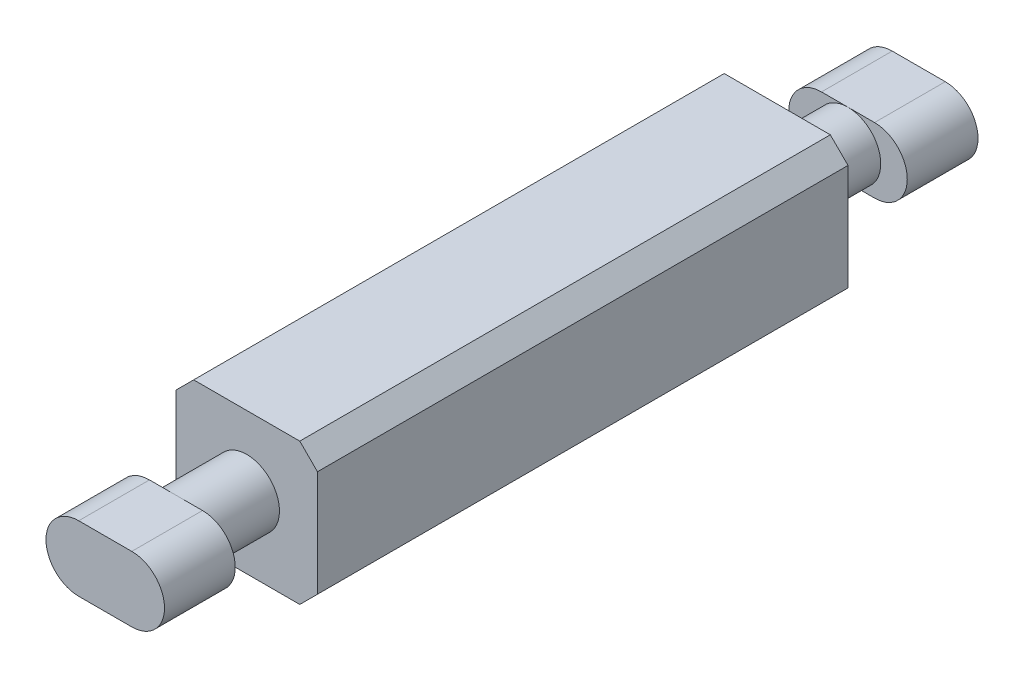
ISO-10303-21;
HEADER;
FILE_DESCRIPTION(('STEP AP214'),'2;1');
FILE_NAME('part.step','',(''),(''),'','','');
FILE_SCHEMA(('AUTOMOTIVE_DESIGN { 1 0 10303 214 1 1 1 1 }'));
ENDSEC;
DATA;
#1=APPLICATION_CONTEXT('core data for automotive mechanical design processes');
#2=APPLICATION_PROTOCOL_DEFINITION('international standard','automotive_design',2000,#1);
#3=PRODUCT_CONTEXT('',#1,'mechanical');
#4=PRODUCT('Part','Part','',(#3));
#5=PRODUCT_RELATED_PRODUCT_CATEGORY('part','',(#4));
#6=PRODUCT_DEFINITION_FORMATION('','',#4);
#7=PRODUCT_DEFINITION_CONTEXT('part definition',#1,'design');
#8=PRODUCT_DEFINITION('design','',#6,#7);
#9=PRODUCT_DEFINITION_SHAPE('','',#8);
#10=(LENGTH_UNIT() NAMED_UNIT(*) SI_UNIT(.MILLI.,.METRE.));
#11=(NAMED_UNIT(*) PLANE_ANGLE_UNIT() SI_UNIT($,.RADIAN.));
#12=(NAMED_UNIT(*) SI_UNIT($,.STERADIAN.) SOLID_ANGLE_UNIT());
#13=UNCERTAINTY_MEASURE_WITH_UNIT(LENGTH_MEASURE(1.E-05),#10,'distance_accuracy_value','');
#14=(GEOMETRIC_REPRESENTATION_CONTEXT(3) GLOBAL_UNCERTAINTY_ASSIGNED_CONTEXT((#13)) GLOBAL_UNIT_ASSIGNED_CONTEXT((#10,
#11,#12)) REPRESENTATION_CONTEXT('',''));
#15=CARTESIAN_POINT('',(0.,0.,0.));
#16=DIRECTION('',(0.,0.,1.));
#17=DIRECTION('',(1.,0.,0.));
#18=AXIS2_PLACEMENT_3D('',#15,#16,#17);
#19=CARTESIAN_POINT('',(2.,4.,7.5));
#20=DIRECTION('',(-1.,0.,0.));
#21=DIRECTION('',(0.,0.,1.));
#22=AXIS2_PLACEMENT_3D('',#19,#20,#21);
#23=PLANE('',#22);
#24=DIRECTION('',(0.,-1.,0.));
#25=VECTOR('',#24,1.);
#26=CARTESIAN_POINT('',(2.,4.,7.5));
#27=LINE('',#26,#25);
#28=CARTESIAN_POINT('',(2.,3.5,7.5));
#29=VERTEX_POINT('',#28);
#30=CARTESIAN_POINT('',(2.,0.5,7.5));
#31=VERTEX_POINT('',#30);
#32=EDGE_CURVE('E272',#29,#31,#27,.T.);
#33=ORIENTED_EDGE('',*,*,#32,.T.);
#34=DIRECTION('',(0.,0.,-1.));
#35=VECTOR('',#34,1.);
#36=CARTESIAN_POINT('',(2.,0.5,-7.5));
#37=LINE('',#36,#35);
#38=CARTESIAN_POINT('',(2.,0.5,-7.5));
#39=VERTEX_POINT('',#38);
#40=EDGE_CURVE('E11',#31,#39,#37,.T.);
#41=ORIENTED_EDGE('',*,*,#40,.T.);
#42=DIRECTION('',(0.,-1.,0.));
#43=VECTOR('',#42,1.);
#44=CARTESIAN_POINT('',(2.,4.,-7.5));
#45=LINE('',#44,#43);
#46=CARTESIAN_POINT('',(2.,3.5,-7.5));
#47=VERTEX_POINT('',#46);
#48=EDGE_CURVE('E290',#47,#39,#45,.T.);
#49=ORIENTED_EDGE('',*,*,#48,.F.);
#50=DIRECTION('',(0.,0.,1.));
#51=VECTOR('',#50,1.);
#52=CARTESIAN_POINT('',(2.,3.5,7.5));
#53=LINE('',#52,#51);
#54=EDGE_CURVE('E51',#47,#29,#53,.T.);
#55=ORIENTED_EDGE('',*,*,#54,.T.);
#56=EDGE_LOOP('',(#33,#41,#49,#55));
#57=FACE_BOUND('',#56,.T.);
#58=ADVANCED_FACE('F41',(#57),#23,.F.);
#59=CARTESIAN_POINT('',(-2.,4.,-7.5));
#60=DIRECTION('',(0.,0.,1.));
#61=DIRECTION('',(1.,0.,0.));
#62=AXIS2_PLACEMENT_3D('',#59,#60,#61);
#63=PLANE('',#62);
#64=CARTESIAN_POINT('',(0.,2.,-7.5));
#65=DIRECTION('',(0.,0.,1.));
#66=DIRECTION('',(1.,0.,0.));
#67=AXIS2_PLACEMENT_3D('',#64,#65,#66);
#68=CIRCLE('',#67,0.925);
#69=CARTESIAN_POINT('',(0.925,2.,-7.5));
#70=VERTEX_POINT('',#69);
#71=EDGE_CURVE('E258',#70,#70,#68,.T.);
#72=ORIENTED_EDGE('',*,*,#71,.T.);
#73=EDGE_LOOP('',(#72));
#74=FACE_BOUND('',#73,.T.);
#75=DIRECTION('',(-1.,0.,0.));
#76=VECTOR('',#75,1.);
#77=CARTESIAN_POINT('',(-2.,0.,-7.5));
#78=LINE('',#77,#76);
#79=CARTESIAN_POINT('',(1.5,0.,-7.5));
#80=VERTEX_POINT('',#79);
#81=CARTESIAN_POINT('',(-1.5,0.,-7.5));
#82=VERTEX_POINT('',#81);
#83=EDGE_CURVE('E262',#80,#82,#78,.T.);
#84=ORIENTED_EDGE('',*,*,#83,.T.);
#85=DIRECTION('',(-0.707106781186549,0.707106781186546,0.));
#86=VECTOR('',#85,1.);
#87=CARTESIAN_POINT('',(-2.,0.5,-7.5));
#88=LINE('',#87,#86);
#89=CARTESIAN_POINT('',(-2.,0.5,-7.5));
#90=VERTEX_POINT('',#89);
#91=EDGE_CURVE('E331',#82,#90,#88,.T.);
#92=ORIENTED_EDGE('',*,*,#91,.T.);
#93=DIRECTION('',(0.,-1.,0.));
#94=VECTOR('',#93,1.);
#95=CARTESIAN_POINT('',(-2.,4.,-7.5));
#96=LINE('',#95,#94);
#97=CARTESIAN_POINT('',(-2.,3.5,-7.5));
#98=VERTEX_POINT('',#97);
#99=EDGE_CURVE('E286',#98,#90,#96,.T.);
#100=ORIENTED_EDGE('',*,*,#99,.F.);
#101=DIRECTION('',(-0.707106781186546,-0.707106781186549,0.));
#102=VECTOR('',#101,1.);
#103=CARTESIAN_POINT('',(-1.5,4.,-7.5));
#104=LINE('',#103,#102);
#105=CARTESIAN_POINT('',(-1.5,4.,-7.5));
#106=VERTEX_POINT('',#105);
#107=EDGE_CURVE('E328',#98,#106,#104,.F.);
#108=ORIENTED_EDGE('',*,*,#107,.T.);
#109=DIRECTION('',(-1.,0.,0.));
#110=VECTOR('',#109,1.);
#111=CARTESIAN_POINT('',(-2.,4.,-7.5));
#112=LINE('',#111,#110);
#113=CARTESIAN_POINT('',(1.5,4.,-7.5));
#114=VERTEX_POINT('',#113);
#115=EDGE_CURVE('E263',#114,#106,#112,.T.);
#116=ORIENTED_EDGE('',*,*,#115,.F.);
#117=DIRECTION('',(-0.707106781186546,0.707106781186549,0.));
#118=VECTOR('',#117,1.);
#119=CARTESIAN_POINT('',(1.5,4.,-7.5));
#120=LINE('',#119,#118);
#121=EDGE_CURVE('E322',#114,#47,#120,.F.);
#122=ORIENTED_EDGE('',*,*,#121,.T.);
#123=ORIENTED_EDGE('',*,*,#48,.T.);
#124=DIRECTION('',(-0.707106781186549,-0.707106781186546,0.));
#125=VECTOR('',#124,1.);
#126=CARTESIAN_POINT('',(2.,0.5,-7.5));
#127=LINE('',#126,#125);
#128=EDGE_CURVE('E325',#39,#80,#127,.T.);
#129=ORIENTED_EDGE('',*,*,#128,.T.);
#130=EDGE_LOOP('',(#84,#92,#100,#108,#116,#122,#123,#129));
#131=FACE_BOUND('',#130,.T.);
#132=ADVANCED_FACE('F359',(#74,#131),#63,.F.);
#133=CARTESIAN_POINT('',(-2.,4.,7.5));
#134=DIRECTION('',(1.,0.,0.));
#135=DIRECTION('',(0.,0.,-1.));
#136=AXIS2_PLACEMENT_3D('',#133,#134,#135);
#137=PLANE('',#136);
#138=ORIENTED_EDGE('',*,*,#99,.T.);
#139=DIRECTION('',(0.,0.,1.));
#140=VECTOR('',#139,1.);
#141=CARTESIAN_POINT('',(-2.,0.5,7.5));
#142=LINE('',#141,#140);
#143=CARTESIAN_POINT('',(-2.,0.5,7.5));
#144=VERTEX_POINT('',#143);
#145=EDGE_CURVE('E300',#90,#144,#142,.T.);
#146=ORIENTED_EDGE('',*,*,#145,.T.);
#147=DIRECTION('',(0.,-1.,0.));
#148=VECTOR('',#147,1.);
#149=CARTESIAN_POINT('',(-2.,4.,7.5));
#150=LINE('',#149,#148);
#151=CARTESIAN_POINT('',(-2.,3.5,7.5));
#152=VERTEX_POINT('',#151);
#153=EDGE_CURVE('E282',#152,#144,#150,.T.);
#154=ORIENTED_EDGE('',*,*,#153,.F.);
#155=DIRECTION('',(0.,0.,-1.));
#156=VECTOR('',#155,1.);
#157=CARTESIAN_POINT('',(-2.,3.5,7.5));
#158=LINE('',#157,#156);
#159=EDGE_CURVE('E294',#152,#98,#158,.T.);
#160=ORIENTED_EDGE('',*,*,#159,.T.);
#161=EDGE_LOOP('',(#138,#146,#154,#160));
#162=FACE_BOUND('',#161,.T.);
#163=ADVANCED_FACE('F367',(#162),#137,.F.);
#164=CARTESIAN_POINT('',(-2.,4.,7.5));
#165=DIRECTION('',(0.,0.,-1.));
#166=DIRECTION('',(-1.,0.,0.));
#167=AXIS2_PLACEMENT_3D('',#164,#165,#166);
#168=PLANE('',#167);
#169=CARTESIAN_POINT('',(0.,2.,7.5));
#170=DIRECTION('',(0.,0.,-1.));
#171=DIRECTION('',(-1.,0.,0.));
#172=AXIS2_PLACEMENT_3D('',#169,#170,#171);
#173=CIRCLE('',#172,0.925);
#174=CARTESIAN_POINT('',(-0.925,2.,7.5));
#175=VERTEX_POINT('',#174);
#176=EDGE_CURVE('E257',#175,#175,#173,.T.);
#177=ORIENTED_EDGE('',*,*,#176,.T.);
#178=EDGE_LOOP('',(#177));
#179=FACE_BOUND('',#178,.T.);
#180=ORIENTED_EDGE('',*,*,#153,.T.);
#181=DIRECTION('',(0.707106781186549,-0.707106781186546,0.));
#182=VECTOR('',#181,1.);
#183=CARTESIAN_POINT('',(-2.,0.5,7.5));
#184=LINE('',#183,#182);
#185=CARTESIAN_POINT('',(-1.5,0.,7.5));
#186=VERTEX_POINT('',#185);
#187=EDGE_CURVE('E313',#144,#186,#184,.T.);
#188=ORIENTED_EDGE('',*,*,#187,.T.);
#189=DIRECTION('',(1.,0.,0.));
#190=VECTOR('',#189,1.);
#191=CARTESIAN_POINT('',(-2.,0.,7.5));
#192=LINE('',#191,#190);
#193=CARTESIAN_POINT('',(1.5,0.,7.5));
#194=VERTEX_POINT('',#193);
#195=EDGE_CURVE('E268',#186,#194,#192,.T.);
#196=ORIENTED_EDGE('',*,*,#195,.T.);
#197=DIRECTION('',(0.707106781186549,0.707106781186546,0.));
#198=VECTOR('',#197,1.);
#199=CARTESIAN_POINT('',(2.,0.5,7.5));
#200=LINE('',#199,#198);
#201=EDGE_CURVE('E307',#194,#31,#200,.T.);
#202=ORIENTED_EDGE('',*,*,#201,.T.);
#203=ORIENTED_EDGE('',*,*,#32,.F.);
#204=DIRECTION('',(0.707106781186546,-0.707106781186549,0.));
#205=VECTOR('',#204,1.);
#206=CARTESIAN_POINT('',(1.5,4.,7.5));
#207=LINE('',#206,#205);
#208=CARTESIAN_POINT('',(1.5,4.,7.5));
#209=VERTEX_POINT('',#208);
#210=EDGE_CURVE('E304',#29,#209,#207,.F.);
#211=ORIENTED_EDGE('',*,*,#210,.T.);
#212=DIRECTION('',(1.,0.,0.));
#213=VECTOR('',#212,1.);
#214=CARTESIAN_POINT('',(-2.,4.,7.5));
#215=LINE('',#214,#213);
#216=CARTESIAN_POINT('',(-1.5,4.,7.5));
#217=VERTEX_POINT('',#216);
#218=EDGE_CURVE('E267',#217,#209,#215,.T.);
#219=ORIENTED_EDGE('',*,*,#218,.F.);
#220=DIRECTION('',(0.707106781186546,0.707106781186549,0.));
#221=VECTOR('',#220,1.);
#222=CARTESIAN_POINT('',(-1.5,4.,7.5));
#223=LINE('',#222,#221);
#224=EDGE_CURVE('E310',#217,#152,#223,.F.);
#225=ORIENTED_EDGE('',*,*,#224,.T.);
#226=EDGE_LOOP('',(#180,#188,#196,#202,#203,#211,#219,#225));
#227=FACE_BOUND('',#226,.T.);
#228=ADVANCED_FACE('F350',(#179,#227),#168,.F.);
#229=CARTESIAN_POINT('',(0.,4.,0.));
#230=DIRECTION('',(0.,-1.,0.));
#231=DIRECTION('',(0.,0.,-1.));
#232=AXIS2_PLACEMENT_3D('',#229,#230,#231);
#233=PLANE('',#232);
#234=ORIENTED_EDGE('',*,*,#115,.T.);
#235=DIRECTION('',(0.,0.,1.));
#236=VECTOR('',#235,1.);
#237=CARTESIAN_POINT('',(-1.5,4.,0.));
#238=LINE('',#237,#236);
#239=EDGE_CURVE('E338',#106,#217,#238,.T.);
#240=ORIENTED_EDGE('',*,*,#239,.T.);
#241=ORIENTED_EDGE('',*,*,#218,.T.);
#242=DIRECTION('',(0.,0.,-1.));
#243=VECTOR('',#242,1.);
#244=CARTESIAN_POINT('',(1.5,4.,0.));
#245=LINE('',#244,#243);
#246=EDGE_CURVE('E334',#209,#114,#245,.T.);
#247=ORIENTED_EDGE('',*,*,#246,.T.);
#248=EDGE_LOOP('',(#234,#240,#241,#247));
#249=FACE_BOUND('',#248,.T.);
#250=ADVANCED_FACE('F356',(#249),#233,.F.);
#251=CARTESIAN_POINT('',(0.,0.,0.));
#252=DIRECTION('',(0.,-1.,0.));
#253=DIRECTION('',(0.,0.,-1.));
#254=AXIS2_PLACEMENT_3D('',#251,#252,#253);
#255=PLANE('',#254);
#256=ORIENTED_EDGE('',*,*,#195,.F.);
#257=DIRECTION('',(0.,0.,-1.));
#258=VECTOR('',#257,1.);
#259=CARTESIAN_POINT('',(-1.5,0.,-7.5));
#260=LINE('',#259,#258);
#261=EDGE_CURVE('E319',#186,#82,#260,.T.);
#262=ORIENTED_EDGE('',*,*,#261,.T.);
#263=ORIENTED_EDGE('',*,*,#83,.F.);
#264=DIRECTION('',(0.,0.,1.));
#265=VECTOR('',#264,1.);
#266=CARTESIAN_POINT('',(1.5,0.,7.5));
#267=LINE('',#266,#265);
#268=EDGE_CURVE('E316',#80,#194,#267,.T.);
#269=ORIENTED_EDGE('',*,*,#268,.T.);
#270=EDGE_LOOP('',(#256,#262,#263,#269));
#271=FACE_BOUND('',#270,.T.);
#272=ADVANCED_FACE('F375',(#271),#255,.T.);
#273=CARTESIAN_POINT('',(0.,2.,-9.50000000000001));
#274=DIRECTION('',(0.,0.,1.));
#275=DIRECTION('',(1.,0.,0.));
#276=AXIS2_PLACEMENT_3D('',#273,#274,#275);
#277=CYLINDRICAL_SURFACE('',#276,0.925);
#278=CARTESIAN_POINT('',(0.,2.,9.5));
#279=DIRECTION('',(0.,0.,1.));
#280=DIRECTION('',(1.,0.,0.));
#281=AXIS2_PLACEMENT_3D('',#278,#279,#280);
#282=CIRCLE('',#281,0.925);
#283=CARTESIAN_POINT('',(0.,2.925,9.5));
#284=VERTEX_POINT('',#283);
#285=CARTESIAN_POINT('',(0.,1.075,9.5));
#286=VERTEX_POINT('',#285);
#287=EDGE_CURVE('E249',#284,#286,#282,.T.);
#288=ORIENTED_EDGE('',*,*,#287,.F.);
#289=EDGE_CURVE('E65',#286,#284,#282,.T.);
#290=ORIENTED_EDGE('',*,*,#289,.F.);
#291=EDGE_LOOP('',(#288,#290));
#292=FACE_BOUND('',#291,.T.);
#293=ORIENTED_EDGE('',*,*,#176,.F.);
#294=EDGE_LOOP('',(#293));
#295=FACE_BOUND('',#294,.T.);
#296=ADVANCED_FACE('F412',(#292,#295),#277,.T.);
#297=CARTESIAN_POINT('',(0.,2.,-9.50000000000001));
#298=DIRECTION('',(0.,0.,1.));
#299=DIRECTION('',(1.,0.,0.));
#300=AXIS2_PLACEMENT_3D('',#297,#298,#299);
#301=CIRCLE('',#300,0.925);
#302=CARTESIAN_POINT('',(0.,2.925,-9.50000000000001));
#303=VERTEX_POINT('',#302);
#304=CARTESIAN_POINT('',(0.,1.075,-9.50000000000001));
#305=VERTEX_POINT('',#304);
#306=EDGE_CURVE('E253',#303,#305,#301,.T.);
#307=ORIENTED_EDGE('',*,*,#306,.T.);
#308=EDGE_CURVE('E252',#305,#303,#301,.T.);
#309=ORIENTED_EDGE('',*,*,#308,.T.);
#310=EDGE_LOOP('',(#307,#309));
#311=FACE_BOUND('',#310,.T.);
#312=ORIENTED_EDGE('',*,*,#71,.F.);
#313=EDGE_LOOP('',(#312));
#314=FACE_BOUND('',#313,.T.);
#315=ADVANCED_FACE('F402',(#311,#314),#277,.T.);
#316=CARTESIAN_POINT('',(-2.,0.5,7.5));
#317=DIRECTION('',(-0.707106781186546,-0.707106781186549,0.));
#318=DIRECTION('',(0.,0.,-1.));
#319=AXIS2_PLACEMENT_3D('',#316,#317,#318);
#320=PLANE('',#319);
#321=ORIENTED_EDGE('',*,*,#91,.F.);
#322=ORIENTED_EDGE('',*,*,#261,.F.);
#323=ORIENTED_EDGE('',*,*,#187,.F.);
#324=ORIENTED_EDGE('',*,*,#145,.F.);
#325=EDGE_LOOP('',(#321,#322,#323,#324));
#326=FACE_BOUND('',#325,.T.);
#327=ADVANCED_FACE('F371',(#326),#320,.T.);
#328=CARTESIAN_POINT('',(-1.5,4.,0.));
#329=DIRECTION('',(0.707106781186549,-0.707106781186546,0.));
#330=DIRECTION('',(0.,0.,1.));
#331=AXIS2_PLACEMENT_3D('',#328,#329,#330);
#332=PLANE('',#331);
#333=ORIENTED_EDGE('',*,*,#107,.F.);
#334=ORIENTED_EDGE('',*,*,#159,.F.);
#335=ORIENTED_EDGE('',*,*,#224,.F.);
#336=ORIENTED_EDGE('',*,*,#239,.F.);
#337=EDGE_LOOP('',(#333,#334,#335,#336));
#338=FACE_BOUND('',#337,.T.);
#339=ADVANCED_FACE('F364',(#338),#332,.F.);
#340=CARTESIAN_POINT('',(2.,0.5,7.5));
#341=DIRECTION('',(0.707106781186546,-0.707106781186549,0.));
#342=DIRECTION('',(0.,0.,1.));
#343=AXIS2_PLACEMENT_3D('',#340,#341,#342);
#344=PLANE('',#343);
#345=ORIENTED_EDGE('',*,*,#201,.F.);
#346=ORIENTED_EDGE('',*,*,#268,.F.);
#347=ORIENTED_EDGE('',*,*,#128,.F.);
#348=ORIENTED_EDGE('',*,*,#40,.F.);
#349=EDGE_LOOP('',(#345,#346,#347,#348));
#350=FACE_BOUND('',#349,.T.);
#351=ADVANCED_FACE('F379',(#350),#344,.T.);
#352=CARTESIAN_POINT('',(1.5,4.,0.));
#353=DIRECTION('',(-0.707106781186549,-0.707106781186546,0.));
#354=DIRECTION('',(0.,0.,-1.));
#355=AXIS2_PLACEMENT_3D('',#352,#353,#354);
#356=PLANE('',#355);
#357=ORIENTED_EDGE('',*,*,#210,.F.);
#358=ORIENTED_EDGE('',*,*,#54,.F.);
#359=ORIENTED_EDGE('',*,*,#121,.F.);
#360=ORIENTED_EDGE('',*,*,#246,.F.);
#361=EDGE_LOOP('',(#357,#358,#359,#360));
#362=FACE_BOUND('',#361,.T.);
#363=ADVANCED_FACE('F44',(#362),#356,.F.);
#364=CARTESIAN_POINT('',(-0.75,2.,9.5));
#365=DIRECTION('',(0.,0.,1.));
#366=DIRECTION('',(1.,0.,0.));
#367=AXIS2_PLACEMENT_3D('',#364,#365,#366);
#368=PLANE('',#367);
#369=DIRECTION('',(-1.,0.,0.));
#370=VECTOR('',#369,1.);
#371=CARTESIAN_POINT('',(-0.75,2.925,9.5));
#372=LINE('',#371,#370);
#373=CARTESIAN_POINT('',(-0.75,2.925,9.5));
#374=VERTEX_POINT('',#373);
#375=EDGE_CURVE('E230',#284,#374,#372,.T.);
#376=ORIENTED_EDGE('',*,*,#375,.F.);
#377=ORIENTED_EDGE('',*,*,#287,.T.);
#378=DIRECTION('',(1.,0.,0.));
#379=VECTOR('',#378,1.);
#380=CARTESIAN_POINT('',(-0.75,1.075,9.5));
#381=LINE('',#380,#379);
#382=CARTESIAN_POINT('',(-0.75,1.075,9.5));
#383=VERTEX_POINT('',#382);
#384=EDGE_CURVE('E223',#383,#286,#381,.T.);
#385=ORIENTED_EDGE('',*,*,#384,.F.);
#386=CARTESIAN_POINT('',(-0.75,2.,9.5));
#387=DIRECTION('',(0.,0.,1.));
#388=DIRECTION('',(1.,0.,0.));
#389=AXIS2_PLACEMENT_3D('',#386,#387,#388);
#390=CIRCLE('',#389,0.925);
#391=EDGE_CURVE('E197',#374,#383,#390,.T.);
#392=ORIENTED_EDGE('',*,*,#391,.F.);
#393=EDGE_LOOP('',(#376,#377,#385,#392));
#394=FACE_BOUND('',#393,.T.);
#395=ADVANCED_FACE('F385',(#394),#368,.F.);
#396=CARTESIAN_POINT('',(0.75,1.075,9.5));
#397=VERTEX_POINT('',#396);
#398=EDGE_CURVE('E202',#286,#397,#381,.T.);
#399=ORIENTED_EDGE('',*,*,#398,.F.);
#400=ORIENTED_EDGE('',*,*,#289,.T.);
#401=CARTESIAN_POINT('',(0.75,2.925,9.5));
#402=VERTEX_POINT('',#401);
#403=EDGE_CURVE('E213',#402,#284,#372,.T.);
#404=ORIENTED_EDGE('',*,*,#403,.F.);
#405=CARTESIAN_POINT('',(0.75,2.,9.5));
#406=DIRECTION('',(0.,0.,1.));
#407=DIRECTION('',(1.,0.,0.));
#408=AXIS2_PLACEMENT_3D('',#405,#406,#407);
#409=CIRCLE('',#408,0.925);
#410=EDGE_CURVE('E227',#397,#402,#409,.T.);
#411=ORIENTED_EDGE('',*,*,#410,.F.);
#412=EDGE_LOOP('',(#399,#400,#404,#411));
#413=FACE_BOUND('',#412,.T.);
#414=ADVANCED_FACE('F463',(#413),#368,.F.);
#415=CARTESIAN_POINT('',(-0.75,2.,11.5));
#416=DIRECTION('',(0.,0.,-1.));
#417=DIRECTION('',(-1.,0.,0.));
#418=AXIS2_PLACEMENT_3D('',#415,#416,#417);
#419=CYLINDRICAL_SURFACE('',#418,0.925);
#420=ORIENTED_EDGE('',*,*,#391,.T.);
#421=DIRECTION('',(0.,0.,-1.));
#422=VECTOR('',#421,1.);
#423=CARTESIAN_POINT('',(-0.75,1.075,11.5));
#424=LINE('',#423,#422);
#425=CARTESIAN_POINT('',(-0.75,1.075,11.5));
#426=VERTEX_POINT('',#425);
#427=EDGE_CURVE('E245',#426,#383,#424,.T.);
#428=ORIENTED_EDGE('',*,*,#427,.F.);
#429=CARTESIAN_POINT('',(-0.75,2.,11.5));
#430=DIRECTION('',(0.,0.,1.));
#431=DIRECTION('',(1.,0.,0.));
#432=AXIS2_PLACEMENT_3D('',#429,#430,#431);
#433=CIRCLE('',#432,0.925);
#434=CARTESIAN_POINT('',(-0.75,2.925,11.5));
#435=VERTEX_POINT('',#434);
#436=EDGE_CURVE('E208',#435,#426,#433,.T.);
#437=ORIENTED_EDGE('',*,*,#436,.F.);
#438=DIRECTION('',(0.,0.,-1.));
#439=VECTOR('',#438,1.);
#440=CARTESIAN_POINT('',(-0.75,2.925,11.5));
#441=LINE('',#440,#439);
#442=EDGE_CURVE('E221',#435,#374,#441,.T.);
#443=ORIENTED_EDGE('',*,*,#442,.T.);
#444=EDGE_LOOP('',(#420,#428,#437,#443));
#445=FACE_BOUND('',#444,.T.);
#446=ADVANCED_FACE('F421',(#445),#419,.T.);
#447=CARTESIAN_POINT('',(-0.75,1.075,11.5));
#448=DIRECTION('',(0.,1.,0.));
#449=DIRECTION('',(-1.,0.,0.));
#450=AXIS2_PLACEMENT_3D('',#447,#448,#449);
#451=PLANE('',#450);
#452=ORIENTED_EDGE('',*,*,#384,.T.);
#453=ORIENTED_EDGE('',*,*,#398,.T.);
#454=DIRECTION('',(0.,0.,-1.));
#455=VECTOR('',#454,1.);
#456=CARTESIAN_POINT('',(0.75,1.075,11.5));
#457=LINE('',#456,#455);
#458=CARTESIAN_POINT('',(0.75,1.075,11.5));
#459=VERTEX_POINT('',#458);
#460=EDGE_CURVE('E241',#459,#397,#457,.T.);
#461=ORIENTED_EDGE('',*,*,#460,.F.);
#462=DIRECTION('',(1.,0.,0.));
#463=VECTOR('',#462,1.);
#464=CARTESIAN_POINT('',(-0.75,1.075,11.5));
#465=LINE('',#464,#463);
#466=EDGE_CURVE('E212',#426,#459,#465,.T.);
#467=ORIENTED_EDGE('',*,*,#466,.F.);
#468=ORIENTED_EDGE('',*,*,#427,.T.);
#469=EDGE_LOOP('',(#452,#453,#461,#467,#468));
#470=FACE_BOUND('',#469,.T.);
#471=ADVANCED_FACE('F481',(#470),#451,.F.);
#472=CARTESIAN_POINT('',(0.75,2.,11.5));
#473=DIRECTION('',(0.,0.,-1.));
#474=DIRECTION('',(-1.,0.,0.));
#475=AXIS2_PLACEMENT_3D('',#472,#473,#474);
#476=CYLINDRICAL_SURFACE('',#475,0.925);
#477=ORIENTED_EDGE('',*,*,#410,.T.);
#478=DIRECTION('',(0.,0.,-1.));
#479=VECTOR('',#478,1.);
#480=CARTESIAN_POINT('',(0.75,2.925,11.5));
#481=LINE('',#480,#479);
#482=CARTESIAN_POINT('',(0.75,2.925,11.5));
#483=VERTEX_POINT('',#482);
#484=EDGE_CURVE('E237',#483,#402,#481,.T.);
#485=ORIENTED_EDGE('',*,*,#484,.F.);
#486=CARTESIAN_POINT('',(0.75,2.,11.5));
#487=DIRECTION('',(0.,0.,1.));
#488=DIRECTION('',(1.,0.,0.));
#489=AXIS2_PLACEMENT_3D('',#486,#487,#488);
#490=CIRCLE('',#489,0.925);
#491=EDGE_CURVE('E216',#459,#483,#490,.T.);
#492=ORIENTED_EDGE('',*,*,#491,.F.);
#493=ORIENTED_EDGE('',*,*,#460,.T.);
#494=EDGE_LOOP('',(#477,#485,#492,#493));
#495=FACE_BOUND('',#494,.T.);
#496=ADVANCED_FACE('F490',(#495),#476,.T.);
#497=CARTESIAN_POINT('',(-0.75,2.925,11.5));
#498=DIRECTION('',(0.,-1.,0.));
#499=DIRECTION('',(1.,0.,0.));
#500=AXIS2_PLACEMENT_3D('',#497,#498,#499);
#501=PLANE('',#500);
#502=ORIENTED_EDGE('',*,*,#403,.T.);
#503=ORIENTED_EDGE('',*,*,#375,.T.);
#504=ORIENTED_EDGE('',*,*,#442,.F.);
#505=DIRECTION('',(-1.,0.,0.));
#506=VECTOR('',#505,1.);
#507=CARTESIAN_POINT('',(-0.75,2.925,11.5));
#508=LINE('',#507,#506);
#509=EDGE_CURVE('E219',#483,#435,#508,.T.);
#510=ORIENTED_EDGE('',*,*,#509,.F.);
#511=ORIENTED_EDGE('',*,*,#484,.T.);
#512=EDGE_LOOP('',(#502,#503,#504,#510,#511));
#513=FACE_BOUND('',#512,.T.);
#514=ADVANCED_FACE('F499',(#513),#501,.F.);
#515=CARTESIAN_POINT('',(-0.75,2.,11.5));
#516=DIRECTION('',(0.,0.,1.));
#517=DIRECTION('',(1.,0.,0.));
#518=AXIS2_PLACEMENT_3D('',#515,#516,#517);
#519=PLANE('',#518);
#520=ORIENTED_EDGE('',*,*,#436,.T.);
#521=ORIENTED_EDGE('',*,*,#466,.T.);
#522=ORIENTED_EDGE('',*,*,#491,.T.);
#523=ORIENTED_EDGE('',*,*,#509,.T.);
#524=EDGE_LOOP('',(#520,#521,#522,#523));
#525=FACE_BOUND('',#524,.T.);
#526=ADVANCED_FACE('F509',(#525),#519,.T.);
#527=CARTESIAN_POINT('',(0.75,2.,-9.50000000000001));
#528=DIRECTION('',(0.,0.,-1.));
#529=DIRECTION('',(-1.,0.,0.));
#530=AXIS2_PLACEMENT_3D('',#527,#528,#529);
#531=PLANE('',#530);
#532=ORIENTED_EDGE('',*,*,#306,.F.);
#533=DIRECTION('',(1.,0.,0.));
#534=VECTOR('',#533,1.);
#535=CARTESIAN_POINT('',(0.75,2.925,-9.50000000000001));
#536=LINE('',#535,#534);
#537=CARTESIAN_POINT('',(-0.749999999999999,2.925,-9.50000000000001));
#538=VERTEX_POINT('',#537);
#539=EDGE_CURVE('E58',#538,#303,#536,.T.);
#540=ORIENTED_EDGE('',*,*,#539,.F.);
#541=CARTESIAN_POINT('',(-0.75,2.,-9.50000000000001));
#542=DIRECTION('',(0.,0.,-1.));
#543=DIRECTION('',(-1.,0.,0.));
#544=AXIS2_PLACEMENT_3D('',#541,#542,#543);
#545=CIRCLE('',#544,0.925);
#546=CARTESIAN_POINT('',(-0.749999999999999,1.075,-9.50000000000001));
#547=VERTEX_POINT('',#546);
#548=EDGE_CURVE('E597',#547,#538,#545,.T.);
#549=ORIENTED_EDGE('',*,*,#548,.F.);
#550=DIRECTION('',(-1.,0.,0.));
#551=VECTOR('',#550,1.);
#552=CARTESIAN_POINT('',(0.75,1.075,-9.50000000000001));
#553=LINE('',#552,#551);
#554=EDGE_CURVE('E596',#305,#547,#553,.T.);
#555=ORIENTED_EDGE('',*,*,#554,.F.);
#556=EDGE_LOOP('',(#532,#540,#549,#555));
#557=FACE_BOUND('',#556,.T.);
#558=ADVANCED_FACE('F518',(#557),#531,.F.);
#559=CARTESIAN_POINT('',(0.75,2.,-11.5));
#560=DIRECTION('',(0.,0.,1.));
#561=DIRECTION('',(1.,0.,0.));
#562=AXIS2_PLACEMENT_3D('',#559,#560,#561);
#563=CYLINDRICAL_SURFACE('',#562,0.925);
#564=CARTESIAN_POINT('',(0.75,2.,-9.50000000000001));
#565=DIRECTION('',(0.,0.,-1.));
#566=DIRECTION('',(-1.,0.,0.));
#567=AXIS2_PLACEMENT_3D('',#564,#565,#566);
#568=CIRCLE('',#567,0.925);
#569=CARTESIAN_POINT('',(0.75,2.925,-9.50000000000001));
#570=VERTEX_POINT('',#569);
#571=CARTESIAN_POINT('',(0.75,1.075,-9.50000000000001));
#572=VERTEX_POINT('',#571);
#573=EDGE_CURVE('E195',#570,#572,#568,.T.);
#574=ORIENTED_EDGE('',*,*,#573,.T.);
#575=DIRECTION('',(0.,0.,1.));
#576=VECTOR('',#575,1.);
#577=CARTESIAN_POINT('',(0.75,1.075,-11.5));
#578=LINE('',#577,#576);
#579=CARTESIAN_POINT('',(0.75,1.075,-11.5));
#580=VERTEX_POINT('',#579);
#581=EDGE_CURVE('E174',#580,#572,#578,.T.);
#582=ORIENTED_EDGE('',*,*,#581,.F.);
#583=CARTESIAN_POINT('',(0.75,2.,-11.5));
#584=DIRECTION('',(0.,0.,-1.));
#585=DIRECTION('',(-1.,0.,0.));
#586=AXIS2_PLACEMENT_3D('',#583,#584,#585);
#587=CIRCLE('',#586,0.925);
#588=CARTESIAN_POINT('',(0.75,2.925,-11.5));
#589=VERTEX_POINT('',#588);
#590=EDGE_CURVE('E182',#589,#580,#587,.T.);
#591=ORIENTED_EDGE('',*,*,#590,.F.);
#592=DIRECTION('',(0.,0.,1.));
#593=VECTOR('',#592,1.);
#594=CARTESIAN_POINT('',(0.75,2.925,-11.5));
#595=LINE('',#594,#593);
#596=EDGE_CURVE('E608',#589,#570,#595,.T.);
#597=ORIENTED_EDGE('',*,*,#596,.T.);
#598=EDGE_LOOP('',(#574,#582,#591,#597));
#599=FACE_BOUND('',#598,.T.);
#600=ADVANCED_FACE('F193',(#599),#563,.T.);
#601=CARTESIAN_POINT('',(0.75,1.075,-11.5));
#602=DIRECTION('',(0.,1.,0.));
#603=DIRECTION('',(-1.,0.,0.));
#604=AXIS2_PLACEMENT_3D('',#601,#602,#603);
#605=PLANE('',#604);
#606=EDGE_CURVE('E591',#572,#305,#553,.T.);
#607=ORIENTED_EDGE('',*,*,#606,.T.);
#608=ORIENTED_EDGE('',*,*,#554,.T.);
#609=DIRECTION('',(0.,0.,1.));
#610=VECTOR('',#609,1.);
#611=CARTESIAN_POINT('',(-0.749999999999999,1.075,-11.5));
#612=LINE('',#611,#610);
#613=CARTESIAN_POINT('',(-0.749999999999999,1.075,-11.5));
#614=VERTEX_POINT('',#613);
#615=EDGE_CURVE('E177',#614,#547,#612,.T.);
#616=ORIENTED_EDGE('',*,*,#615,.F.);
#617=DIRECTION('',(-1.,0.,0.));
#618=VECTOR('',#617,1.);
#619=CARTESIAN_POINT('',(0.75,1.075,-11.5));
#620=LINE('',#619,#618);
#621=EDGE_CURVE('E169',#580,#614,#620,.T.);
#622=ORIENTED_EDGE('',*,*,#621,.F.);
#623=ORIENTED_EDGE('',*,*,#581,.T.);
#624=EDGE_LOOP('',(#607,#608,#616,#622,#623));
#625=FACE_BOUND('',#624,.T.);
#626=ADVANCED_FACE('F172',(#625),#605,.F.);
#627=CARTESIAN_POINT('',(-0.75,2.,-11.5));
#628=DIRECTION('',(0.,0.,1.));
#629=DIRECTION('',(1.,0.,0.));
#630=AXIS2_PLACEMENT_3D('',#627,#628,#629);
#631=CYLINDRICAL_SURFACE('',#630,0.925);
#632=ORIENTED_EDGE('',*,*,#548,.T.);
#633=DIRECTION('',(0.,0.,1.));
#634=VECTOR('',#633,1.);
#635=CARTESIAN_POINT('',(-0.749999999999999,2.925,-11.5));
#636=LINE('',#635,#634);
#637=CARTESIAN_POINT('',(-0.749999999999999,2.925,-11.5));
#638=VERTEX_POINT('',#637);
#639=EDGE_CURVE('E204',#638,#538,#636,.T.);
#640=ORIENTED_EDGE('',*,*,#639,.F.);
#641=CARTESIAN_POINT('',(-0.75,2.,-11.5));
#642=DIRECTION('',(0.,0.,-1.));
#643=DIRECTION('',(-1.,0.,0.));
#644=AXIS2_PLACEMENT_3D('',#641,#642,#643);
#645=CIRCLE('',#644,0.925);
#646=EDGE_CURVE('E181',#614,#638,#645,.T.);
#647=ORIENTED_EDGE('',*,*,#646,.F.);
#648=ORIENTED_EDGE('',*,*,#615,.T.);
#649=EDGE_LOOP('',(#632,#640,#647,#648));
#650=FACE_BOUND('',#649,.T.);
#651=ADVANCED_FACE('F551',(#650),#631,.T.);
#652=CARTESIAN_POINT('',(0.75,2.925,-11.5));
#653=DIRECTION('',(0.,-1.,0.));
#654=DIRECTION('',(1.,0.,0.));
#655=AXIS2_PLACEMENT_3D('',#652,#653,#654);
#656=PLANE('',#655);
#657=ORIENTED_EDGE('',*,*,#539,.T.);
#658=EDGE_CURVE('E592',#303,#570,#536,.T.);
#659=ORIENTED_EDGE('',*,*,#658,.T.);
#660=ORIENTED_EDGE('',*,*,#596,.F.);
#661=DIRECTION('',(1.,0.,0.));
#662=VECTOR('',#661,1.);
#663=CARTESIAN_POINT('',(0.75,2.925,-11.5));
#664=LINE('',#663,#662);
#665=EDGE_CURVE('E187',#638,#589,#664,.T.);
#666=ORIENTED_EDGE('',*,*,#665,.F.);
#667=ORIENTED_EDGE('',*,*,#639,.T.);
#668=EDGE_LOOP('',(#657,#659,#660,#666,#667));
#669=FACE_BOUND('',#668,.T.);
#670=ADVANCED_FACE('F560',(#669),#656,.F.);
#671=CARTESIAN_POINT('',(0.75,2.,-11.5));
#672=DIRECTION('',(0.,0.,-1.));
#673=DIRECTION('',(-1.,0.,0.));
#674=AXIS2_PLACEMENT_3D('',#671,#672,#673);
#675=PLANE('',#674);
#676=ORIENTED_EDGE('',*,*,#590,.T.);
#677=ORIENTED_EDGE('',*,*,#621,.T.);
#678=ORIENTED_EDGE('',*,*,#646,.T.);
#679=ORIENTED_EDGE('',*,*,#665,.T.);
#680=EDGE_LOOP('',(#676,#677,#678,#679));
#681=FACE_BOUND('',#680,.T.);
#682=ADVANCED_FACE('F185',(#681),#675,.T.);
#683=ORIENTED_EDGE('',*,*,#308,.F.);
#684=ORIENTED_EDGE('',*,*,#606,.F.);
#685=ORIENTED_EDGE('',*,*,#573,.F.);
#686=ORIENTED_EDGE('',*,*,#658,.F.);
#687=EDGE_LOOP('',(#683,#684,#685,#686));
#688=FACE_BOUND('',#687,.T.);
#689=ADVANCED_FACE('F535',(#688),#531,.F.);
#690=CLOSED_SHELL('',(#58,#132,#163,#228,#250,#272,#296,#315,#327,#339,#351,#363,#395,#414,#446,
#471,#496,#514,#526,#558,#600,#626,#651,#670,#682,#689));
#691=MANIFOLD_SOLID_BREP('B2',#690);
#692=ADVANCED_BREP_SHAPE_REPRESENTATION('',(#18,#691),#14);
#693=SHAPE_DEFINITION_REPRESENTATION(#9,#692);
ENDSEC;
END-ISO-10303-21;
